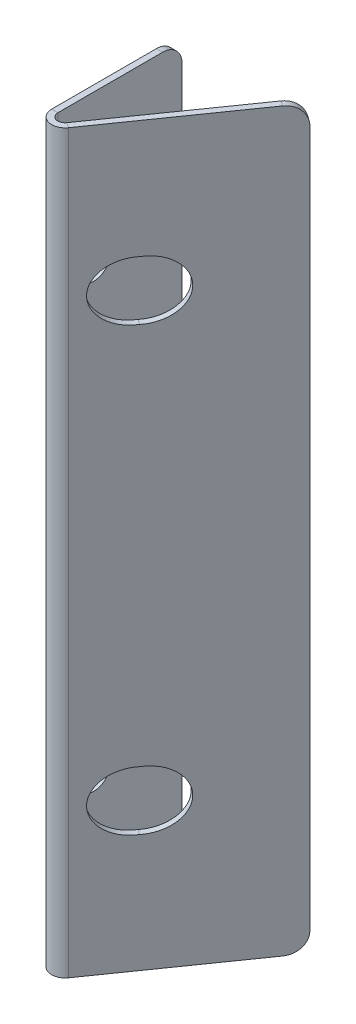
ISO-10303-21;
HEADER;
FILE_DESCRIPTION(('STEP AP214'),'2;1');
FILE_NAME('part.step','',(''),(''),'','','');
FILE_SCHEMA(('AUTOMOTIVE_DESIGN { 1 0 10303 214 1 1 1 1 }'));
ENDSEC;
DATA;
#1=APPLICATION_CONTEXT('core data for automotive mechanical design processes');
#2=APPLICATION_PROTOCOL_DEFINITION('international standard','automotive_design',2000,#1);
#3=PRODUCT_CONTEXT('',#1,'mechanical');
#4=PRODUCT('Part','Part','',(#3));
#5=PRODUCT_RELATED_PRODUCT_CATEGORY('part','',(#4));
#6=PRODUCT_DEFINITION_FORMATION('','',#4);
#7=PRODUCT_DEFINITION_CONTEXT('part definition',#1,'design');
#8=PRODUCT_DEFINITION('design','',#6,#7);
#9=PRODUCT_DEFINITION_SHAPE('','',#8);
#10=(LENGTH_UNIT() NAMED_UNIT(*) SI_UNIT(.MILLI.,.METRE.));
#11=(NAMED_UNIT(*) PLANE_ANGLE_UNIT() SI_UNIT($,.RADIAN.));
#12=(NAMED_UNIT(*) SI_UNIT($,.STERADIAN.) SOLID_ANGLE_UNIT());
#13=UNCERTAINTY_MEASURE_WITH_UNIT(LENGTH_MEASURE(1.E-05),#10,'distance_accuracy_value','');
#14=(GEOMETRIC_REPRESENTATION_CONTEXT(3) GLOBAL_UNCERTAINTY_ASSIGNED_CONTEXT((#13)) GLOBAL_UNIT_ASSIGNED_CONTEXT((#10,
#11,#12)) REPRESENTATION_CONTEXT('',''));
#15=CARTESIAN_POINT('',(0.,0.,0.));
#16=DIRECTION('',(0.,0.,1.));
#17=DIRECTION('',(1.,0.,0.));
#18=AXIS2_PLACEMENT_3D('',#15,#16,#17);
#19=CARTESIAN_POINT('',(0.520161548123511,0.,0.364221037082916));
#20=DIRECTION('',(-0.819152044288991,0.,-0.573576436351047));
#21=DIRECTION('',(-0.573576436351047,0.,0.819152044288991));
#22=AXIS2_PLACEMENT_3D('',#19,#20,#21);
#23=PLANE('',#22);
#24=CARTESIAN_POINT('',(4.9764370931218,-15.,-6.00000000000001));
#25=DIRECTION('',(-0.819152044288991,0.,-0.573576436351047));
#26=DIRECTION('',(-0.573576436351047,0.,0.819152044288991));
#27=AXIS2_PLACEMENT_3D('',#24,#25,#26);
#28=ELLIPSE('',#27,3.66232376628437,3.);
#29=CARTESIAN_POINT('',(4.84892193525177,-17.9944675251264,-5.81788948145852));
#30=VERTEX_POINT('',#29);
#31=CARTESIAN_POINT('',(4.84892193525177,-12.0055324748736,-5.81788948145852));
#32=VERTEX_POINT('',#31);
#33=EDGE_CURVE('E170',#30,#32,#28,.F.);
#34=ORIENTED_EDGE('',*,*,#33,.F.);
#35=CARTESIAN_POINT('',(4.72140677738179,-15.,-5.63577896291709));
#36=DIRECTION('',(-0.819152044288991,0.,-0.573576436351047));
#37=DIRECTION('',(-0.573576436351047,0.,0.819152044288991));
#38=AXIS2_PLACEMENT_3D('',#35,#36,#37);
#39=ELLIPSE('',#38,3.66232376628437,3.);
#40=EDGE_CURVE('E161',#32,#30,#39,.F.);
#41=ORIENTED_EDGE('',*,*,#40,.F.);
#42=EDGE_LOOP('',(#34,#41));
#43=FACE_BOUND('',#42,.T.);
#44=CARTESIAN_POINT('',(4.97643709312179,-60.,-6.));
#45=DIRECTION('',(-0.819152044288991,0.,-0.573576436351047));
#46=DIRECTION('',(-0.573576436351047,0.,0.819152044288991));
#47=AXIS2_PLACEMENT_3D('',#44,#45,#46);
#48=ELLIPSE('',#47,3.66232376628437,3.);
#49=CARTESIAN_POINT('',(4.84892193525195,-62.9944675251264,-5.81788948145878));
#50=VERTEX_POINT('',#49);
#51=CARTESIAN_POINT('',(4.84892193525196,-57.0055324748736,-5.81788948145878));
#52=VERTEX_POINT('',#51);
#53=EDGE_CURVE('E175',#50,#52,#48,.F.);
#54=ORIENTED_EDGE('',*,*,#53,.F.);
#55=CARTESIAN_POINT('',(4.72140677738178,-60.,-5.63577896291709));
#56=DIRECTION('',(-0.819152044288991,0.,-0.573576436351047));
#57=DIRECTION('',(-0.573576436351047,0.,0.819152044288991));
#58=AXIS2_PLACEMENT_3D('',#55,#56,#57);
#59=ELLIPSE('',#58,3.66232376628437,3.);
#60=EDGE_CURVE('E204',#52,#50,#59,.F.);
#61=ORIENTED_EDGE('',*,*,#60,.F.);
#62=EDGE_LOOP('',(#54,#61));
#63=FACE_BOUND('',#62,.T.);
#64=DIRECTION('',(0.573576436351047,0.,-0.819152044288991));
#65=VECTOR('',#64,1.);
#66=CARTESIAN_POINT('',(11.9916902751445,-75.,-16.0188198486969));
#67=LINE('',#66,#65);
#68=CARTESIAN_POINT('',(1.86014894394678,-75.,-1.54947929132165));
#69=VERTEX_POINT('',#68);
#70=CARTESIAN_POINT('',(10.8445374024424,-75.,-14.3805157601189));
#71=VERTEX_POINT('',#70);
#72=EDGE_CURVE('E235',#69,#71,#67,.T.);
#73=ORIENTED_EDGE('',*,*,#72,.T.);
#74=CARTESIAN_POINT('',(10.8445374024424,-73.,-14.3805157601189));
#75=DIRECTION('',(-0.819152044288991,0.,-0.573576436351047));
#76=DIRECTION('',(-0.573576436351047,0.,0.819152044288991));
#77=AXIS2_PLACEMENT_3D('',#74,#75,#76);
#78=CIRCLE('',#77,2.);
#79=CARTESIAN_POINT('',(11.9916902751445,-73.,-16.0188198486969));
#80=VERTEX_POINT('',#79);
#81=EDGE_CURVE('E312',#71,#80,#78,.F.);
#82=ORIENTED_EDGE('',*,*,#81,.T.);
#83=DIRECTION('',(0.,1.,0.));
#84=VECTOR('',#83,1.);
#85=CARTESIAN_POINT('',(11.9916902751445,0.,-16.0188198486969));
#86=LINE('',#85,#84);
#87=CARTESIAN_POINT('',(11.9916902751445,-2.,-16.0188198486969));
#88=VERTEX_POINT('',#87);
#89=EDGE_CURVE('E238',#80,#88,#86,.T.);
#90=ORIENTED_EDGE('',*,*,#89,.T.);
#91=CARTESIAN_POINT('',(10.8445374024424,-2.,-14.3805157601189));
#92=DIRECTION('',(-0.819152044288991,0.,-0.573576436351047));
#93=DIRECTION('',(-0.573576436351047,0.,0.819152044288991));
#94=AXIS2_PLACEMENT_3D('',#91,#92,#93);
#95=CIRCLE('',#94,2.);
#96=CARTESIAN_POINT('',(10.8445374024424,0.,-14.3805157601189));
#97=VERTEX_POINT('',#96);
#98=EDGE_CURVE('E53',#88,#97,#95,.F.);
#99=ORIENTED_EDGE('',*,*,#98,.T.);
#100=DIRECTION('',(-0.573576436351047,0.,0.819152044288991));
#101=VECTOR('',#100,1.);
#102=CARTESIAN_POINT('',(0.520161548123509,0.,0.364221037082915));
#103=LINE('',#102,#101);
#104=CARTESIAN_POINT('',(1.86014894394678,0.,-1.54947929132164));
#105=VERTEX_POINT('',#104);
#106=EDGE_CURVE('E233',#97,#105,#103,.T.);
#107=ORIENTED_EDGE('',*,*,#106,.T.);
#108=DIRECTION('',(0.,1.,0.));
#109=VECTOR('',#108,1.);
#110=CARTESIAN_POINT('',(1.86014894394678,0.,-1.54947929132164));
#111=LINE('',#110,#109);
#112=EDGE_CURVE('E227',#69,#105,#111,.T.);
#113=ORIENTED_EDGE('',*,*,#112,.F.);
#114=EDGE_LOOP('',(#73,#82,#90,#99,#107,#113));
#115=FACE_BOUND('',#114,.T.);
#116=ADVANCED_FACE('F38',(#43,#63,#115),#23,.F.);
#117=CARTESIAN_POINT('',(0.,0.,0.));
#118=DIRECTION('',(-0.819152044288991,0.,-0.573576436351047));
#119=DIRECTION('',(-0.573576436351047,0.,0.819152044288991));
#120=AXIS2_PLACEMENT_3D('',#117,#118,#119);
#121=PLANE('',#120);
#122=CARTESIAN_POINT('',(4.20124522925828,-15.,-6.00000000000001));
#123=DIRECTION('',(-0.819152044288991,0.,-0.573576436351047));
#124=DIRECTION('',(-0.573576436351047,0.,0.819152044288991));
#125=AXIS2_PLACEMENT_3D('',#122,#123,#124);
#126=ELLIPSE('',#125,3.66232376628437,3.);
#127=CARTESIAN_POINT('',(4.32876038712845,-12.0055324748736,-6.1821105185417));
#128=VERTEX_POINT('',#127);
#129=CARTESIAN_POINT('',(4.32876038712845,-17.9944675251264,-6.1821105185417));
#130=VERTEX_POINT('',#129);
#131=EDGE_CURVE('E158',#128,#130,#126,.F.);
#132=ORIENTED_EDGE('',*,*,#131,.T.);
#133=CARTESIAN_POINT('',(4.4562755449983,-15.,-6.36422103708292));
#134=DIRECTION('',(-0.819152044288991,0.,-0.573576436351047));
#135=DIRECTION('',(-0.573576436351047,0.,0.819152044288991));
#136=AXIS2_PLACEMENT_3D('',#133,#134,#135);
#137=ELLIPSE('',#136,3.66232376628437,3.);
#138=EDGE_CURVE('E165',#130,#128,#137,.F.);
#139=ORIENTED_EDGE('',*,*,#138,.T.);
#140=EDGE_LOOP('',(#132,#139));
#141=FACE_BOUND('',#140,.T.);
#142=CARTESIAN_POINT('',(4.20124522925827,-60.,-6.));
#143=DIRECTION('',(-0.819152044288991,0.,-0.573576436351047));
#144=DIRECTION('',(-0.573576436351047,0.,0.819152044288991));
#145=AXIS2_PLACEMENT_3D('',#142,#143,#144);
#146=ELLIPSE('',#145,3.66232376628437,3.);
#147=CARTESIAN_POINT('',(4.32876038712845,-57.0055324748736,-6.1821105185417));
#148=VERTEX_POINT('',#147);
#149=CARTESIAN_POINT('',(4.32876038712844,-62.9944675251264,-6.1821105185417));
#150=VERTEX_POINT('',#149);
#151=EDGE_CURVE('E203',#148,#150,#146,.F.);
#152=ORIENTED_EDGE('',*,*,#151,.T.);
#153=CARTESIAN_POINT('',(4.45627554499829,-60.,-6.36422103708292));
#154=DIRECTION('',(-0.819152044288991,0.,-0.573576436351047));
#155=DIRECTION('',(-0.573576436351047,0.,0.819152044288991));
#156=AXIS2_PLACEMENT_3D('',#153,#154,#155);
#157=ELLIPSE('',#156,3.66232376628437,3.);
#158=EDGE_CURVE('E181',#150,#148,#157,.F.);
#159=ORIENTED_EDGE('',*,*,#158,.T.);
#160=EDGE_LOOP('',(#152,#159));
#161=FACE_BOUND('',#160,.T.);
#162=DIRECTION('',(0.,1.,0.));
#163=VECTOR('',#162,1.);
#164=CARTESIAN_POINT('',(11.4715287270209,0.,-16.3830408857798));
#165=LINE('',#164,#163);
#166=CARTESIAN_POINT('',(11.4715287270209,-73.,-16.3830408857798));
#167=VERTEX_POINT('',#166);
#168=CARTESIAN_POINT('',(11.4715287270209,-2.,-16.3830408857798));
#169=VERTEX_POINT('',#168);
#170=EDGE_CURVE('E236',#167,#169,#165,.T.);
#171=ORIENTED_EDGE('',*,*,#170,.F.);
#172=CARTESIAN_POINT('',(10.3243758543189,-73.,-14.7447367972018));
#173=DIRECTION('',(-0.819152044288991,0.,-0.573576436351047));
#174=DIRECTION('',(-0.573576436351047,0.,0.819152044288991));
#175=AXIS2_PLACEMENT_3D('',#172,#173,#174);
#176=CIRCLE('',#175,2.);
#177=CARTESIAN_POINT('',(10.3243758543189,-75.,-14.7447367972018));
#178=VERTEX_POINT('',#177);
#179=EDGE_CURVE('E308',#167,#178,#176,.T.);
#180=ORIENTED_EDGE('',*,*,#179,.T.);
#181=DIRECTION('',(0.573576436351047,0.,-0.819152044288991));
#182=VECTOR('',#181,1.);
#183=CARTESIAN_POINT('',(11.4715287270209,-75.,-16.3830408857798));
#184=LINE('',#183,#182);
#185=CARTESIAN_POINT('',(1.33998739582328,-75.,-1.91370032840456));
#186=VERTEX_POINT('',#185);
#187=EDGE_CURVE('E242',#186,#178,#184,.T.);
#188=ORIENTED_EDGE('',*,*,#187,.F.);
#189=DIRECTION('',(0.,-1.,0.));
#190=VECTOR('',#189,1.);
#191=CARTESIAN_POINT('',(1.33998739582327,0.,-1.91370032840456));
#192=LINE('',#191,#190);
#193=CARTESIAN_POINT('',(1.33998739582327,0.,-1.91370032840456));
#194=VERTEX_POINT('',#193);
#195=EDGE_CURVE('E222',#194,#186,#192,.T.);
#196=ORIENTED_EDGE('',*,*,#195,.F.);
#197=DIRECTION('',(-0.573576436351047,0.,0.819152044288991));
#198=VECTOR('',#197,1.);
#199=CARTESIAN_POINT('',(0.,0.,0.));
#200=LINE('',#199,#198);
#201=CARTESIAN_POINT('',(10.3243758543189,0.,-14.7447367972018));
#202=VERTEX_POINT('',#201);
#203=EDGE_CURVE('E232',#202,#194,#200,.T.);
#204=ORIENTED_EDGE('',*,*,#203,.F.);
#205=CARTESIAN_POINT('',(10.3243758543189,-2.,-14.7447367972018));
#206=DIRECTION('',(-0.819152044288991,0.,-0.573576436351047));
#207=DIRECTION('',(-0.573576436351047,0.,0.819152044288991));
#208=AXIS2_PLACEMENT_3D('',#205,#206,#207);
#209=CIRCLE('',#208,2.);
#210=EDGE_CURVE('E306',#202,#169,#209,.T.);
#211=ORIENTED_EDGE('',*,*,#210,.T.);
#212=EDGE_LOOP('',(#171,#180,#188,#196,#204,#211));
#213=FACE_BOUND('',#212,.T.);
#214=ADVANCED_FACE('F172',(#141,#161,#213),#121,.T.);
#215=CARTESIAN_POINT('',(-0.635,0.,0.));
#216=DIRECTION('',(1.,0.,0.));
#217=DIRECTION('',(0.,0.,-1.));
#218=AXIS2_PLACEMENT_3D('',#215,#216,#217);
#219=PLANE('',#218);
#220=CARTESIAN_POINT('',(-0.635,-15.,-6.00000000000001));
#221=DIRECTION('',(1.,0.,0.));
#222=DIRECTION('',(0.,0.,-1.));
#223=AXIS2_PLACEMENT_3D('',#220,#221,#222);
#224=CIRCLE('',#223,1.7);
#225=CARTESIAN_POINT('',(-0.635,-15.,-7.70000000000001));
#226=VERTEX_POINT('',#225);
#227=EDGE_CURVE('E216',#226,#226,#224,.T.);
#228=ORIENTED_EDGE('',*,*,#227,.T.);
#229=EDGE_LOOP('',(#228));
#230=FACE_BOUND('',#229,.T.);
#231=DIRECTION('',(0.,1.,0.));
#232=VECTOR('',#231,1.);
#233=CARTESIAN_POINT('',(-0.635,0.,-15.));
#234=LINE('',#233,#232);
#235=CARTESIAN_POINT('',(-0.635,-73.,-15.));
#236=VERTEX_POINT('',#235);
#237=CARTESIAN_POINT('',(-0.635,-2.,-15.));
#238=VERTEX_POINT('',#237);
#239=EDGE_CURVE('E273',#236,#238,#234,.T.);
#240=ORIENTED_EDGE('',*,*,#239,.F.);
#241=CARTESIAN_POINT('',(-0.635,-73.,-13.));
#242=DIRECTION('',(1.,0.,0.));
#243=DIRECTION('',(0.,0.,-1.));
#244=AXIS2_PLACEMENT_3D('',#241,#242,#243);
#245=CIRCLE('',#244,2.);
#246=CARTESIAN_POINT('',(-0.635,-75.,-13.));
#247=VERTEX_POINT('',#246);
#248=EDGE_CURVE('E299',#236,#247,#245,.F.);
#249=ORIENTED_EDGE('',*,*,#248,.T.);
#250=DIRECTION('',(0.,0.,-1.));
#251=VECTOR('',#250,1.);
#252=CARTESIAN_POINT('',(-0.635,-75.,0.));
#253=LINE('',#252,#251);
#254=CARTESIAN_POINT('',(-0.635000000000007,-75.,-2.33619673142075));
#255=VERTEX_POINT('',#254);
#256=EDGE_CURVE('E270',#255,#247,#253,.T.);
#257=ORIENTED_EDGE('',*,*,#256,.F.);
#258=DIRECTION('',(0.,-1.,0.));
#259=VECTOR('',#258,1.);
#260=CARTESIAN_POINT('',(-0.635000000000007,-75.,-2.33619673142075));
#261=LINE('',#260,#259);
#262=CARTESIAN_POINT('',(-0.635,0.,-2.33619673142075));
#263=VERTEX_POINT('',#262);
#264=EDGE_CURVE('E246',#255,#263,#261,.F.);
#265=ORIENTED_EDGE('',*,*,#264,.T.);
#266=DIRECTION('',(0.,0.,1.));
#267=VECTOR('',#266,1.);
#268=CARTESIAN_POINT('',(-0.635,0.,0.));
#269=LINE('',#268,#267);
#270=CARTESIAN_POINT('',(-0.635,0.,-13.));
#271=VERTEX_POINT('',#270);
#272=EDGE_CURVE('E277',#271,#263,#269,.T.);
#273=ORIENTED_EDGE('',*,*,#272,.F.);
#274=CARTESIAN_POINT('',(-0.635,-2.,-13.));
#275=DIRECTION('',(1.,0.,0.));
#276=DIRECTION('',(0.,0.,-1.));
#277=AXIS2_PLACEMENT_3D('',#274,#275,#276);
#278=CIRCLE('',#277,2.);
#279=EDGE_CURVE('E297',#271,#238,#278,.F.);
#280=ORIENTED_EDGE('',*,*,#279,.T.);
#281=EDGE_LOOP('',(#240,#249,#257,#265,#273,#280));
#282=FACE_BOUND('',#281,.T.);
#283=CARTESIAN_POINT('',(-0.635,-60.,-6.));
#284=DIRECTION('',(1.,0.,0.));
#285=DIRECTION('',(0.,0.,-1.));
#286=AXIS2_PLACEMENT_3D('',#283,#284,#285);
#287=CIRCLE('',#286,1.7);
#288=CARTESIAN_POINT('',(-0.635,-60.,-7.7));
#289=VERTEX_POINT('',#288);
#290=EDGE_CURVE('E210',#289,#289,#287,.T.);
#291=ORIENTED_EDGE('',*,*,#290,.T.);
#292=EDGE_LOOP('',(#291));
#293=FACE_BOUND('',#292,.T.);
#294=ADVANCED_FACE('F323',(#230,#282,#293),#219,.F.);
#295=CARTESIAN_POINT('',(0.,0.,0.));
#296=DIRECTION('',(1.,0.,0.));
#297=DIRECTION('',(0.,0.,-1.));
#298=AXIS2_PLACEMENT_3D('',#295,#296,#297);
#299=PLANE('',#298);
#300=CARTESIAN_POINT('',(0.,-15.,-6.00000000000001));
#301=DIRECTION('',(1.,0.,0.));
#302=DIRECTION('',(0.,0.,-1.));
#303=AXIS2_PLACEMENT_3D('',#300,#301,#302);
#304=CIRCLE('',#303,1.7);
#305=CARTESIAN_POINT('',(0.,-15.,-7.70000000000001));
#306=VERTEX_POINT('',#305);
#307=EDGE_CURVE('E213',#306,#306,#304,.T.);
#308=ORIENTED_EDGE('',*,*,#307,.F.);
#309=EDGE_LOOP('',(#308));
#310=FACE_BOUND('',#309,.T.);
#311=DIRECTION('',(0.,0.,-1.));
#312=VECTOR('',#311,1.);
#313=CARTESIAN_POINT('',(0.,-75.,0.));
#314=LINE('',#313,#312);
#315=CARTESIAN_POINT('',(0.,-75.,-2.33619673142075));
#316=VERTEX_POINT('',#315);
#317=CARTESIAN_POINT('',(0.,-75.,-13.));
#318=VERTEX_POINT('',#317);
#319=EDGE_CURVE('E267',#316,#318,#314,.T.);
#320=ORIENTED_EDGE('',*,*,#319,.T.);
#321=CARTESIAN_POINT('',(0.,-73.,-13.));
#322=DIRECTION('',(1.,0.,0.));
#323=DIRECTION('',(0.,0.,-1.));
#324=AXIS2_PLACEMENT_3D('',#321,#322,#323);
#325=CIRCLE('',#324,2.);
#326=CARTESIAN_POINT('',(0.,-73.,-15.));
#327=VERTEX_POINT('',#326);
#328=EDGE_CURVE('E290',#318,#327,#325,.T.);
#329=ORIENTED_EDGE('',*,*,#328,.T.);
#330=DIRECTION('',(0.,1.,0.));
#331=VECTOR('',#330,1.);
#332=CARTESIAN_POINT('',(0.,0.,-15.));
#333=LINE('',#332,#331);
#334=CARTESIAN_POINT('',(0.,-2.,-15.));
#335=VERTEX_POINT('',#334);
#336=EDGE_CURVE('E282',#327,#335,#333,.T.);
#337=ORIENTED_EDGE('',*,*,#336,.T.);
#338=CARTESIAN_POINT('',(0.,-2.,-13.));
#339=DIRECTION('',(1.,0.,0.));
#340=DIRECTION('',(0.,0.,-1.));
#341=AXIS2_PLACEMENT_3D('',#338,#339,#340);
#342=CIRCLE('',#341,2.);
#343=CARTESIAN_POINT('',(0.,0.,-13.));
#344=VERTEX_POINT('',#343);
#345=EDGE_CURVE('E288',#335,#344,#342,.T.);
#346=ORIENTED_EDGE('',*,*,#345,.T.);
#347=DIRECTION('',(0.,0.,1.));
#348=VECTOR('',#347,1.);
#349=CARTESIAN_POINT('',(0.,0.,0.));
#350=LINE('',#349,#348);
#351=CARTESIAN_POINT('',(0.,0.,-2.33619673142075));
#352=VERTEX_POINT('',#351);
#353=EDGE_CURVE('E274',#344,#352,#350,.T.);
#354=ORIENTED_EDGE('',*,*,#353,.T.);
#355=DIRECTION('',(0.,-1.,0.));
#356=VECTOR('',#355,1.);
#357=CARTESIAN_POINT('',(0.,-75.,-2.33619673142075));
#358=LINE('',#357,#356);
#359=EDGE_CURVE('E259',#316,#352,#358,.F.);
#360=ORIENTED_EDGE('',*,*,#359,.F.);
#361=EDGE_LOOP('',(#320,#329,#337,#346,#354,#360));
#362=FACE_BOUND('',#361,.T.);
#363=CARTESIAN_POINT('',(0.,-60.,-6.));
#364=DIRECTION('',(1.,0.,0.));
#365=DIRECTION('',(0.,0.,-1.));
#366=AXIS2_PLACEMENT_3D('',#363,#364,#365);
#367=CIRCLE('',#366,1.7);
#368=CARTESIAN_POINT('',(0.,-60.,-7.7));
#369=VERTEX_POINT('',#368);
#370=EDGE_CURVE('E206',#369,#369,#367,.T.);
#371=ORIENTED_EDGE('',*,*,#370,.F.);
#372=EDGE_LOOP('',(#371));
#373=FACE_BOUND('',#372,.T.);
#374=ADVANCED_FACE('F333',(#310,#362,#373),#299,.T.);
#375=CARTESIAN_POINT('',(-0.635,-75.,0.));
#376=DIRECTION('',(0.,-1.,0.));
#377=DIRECTION('',(0.,0.,-1.));
#378=AXIS2_PLACEMENT_3D('',#375,#376,#377);
#379=PLANE('',#378);
#380=ORIENTED_EDGE('',*,*,#256,.T.);
#381=DIRECTION('',(1.,0.,0.));
#382=VECTOR('',#381,1.);
#383=CARTESIAN_POINT('',(-0.635,-75.,-13.));
#384=LINE('',#383,#382);
#385=EDGE_CURVE('E279',#247,#318,#384,.T.);
#386=ORIENTED_EDGE('',*,*,#385,.T.);
#387=ORIENTED_EDGE('',*,*,#319,.F.);
#388=DIRECTION('',(-1.,0.,0.));
#389=VECTOR('',#388,1.);
#390=CARTESIAN_POINT('',(0.,-75.,-2.33619673142075));
#391=LINE('',#390,#389);
#392=EDGE_CURVE('E253',#316,#255,#391,.T.);
#393=ORIENTED_EDGE('',*,*,#392,.T.);
#394=EDGE_LOOP('',(#380,#386,#387,#393));
#395=FACE_BOUND('',#394,.T.);
#396=ADVANCED_FACE('F341',(#395),#379,.T.);
#397=CARTESIAN_POINT('',(-0.635,0.,0.));
#398=DIRECTION('',(0.,1.,0.));
#399=DIRECTION('',(0.,0.,1.));
#400=AXIS2_PLACEMENT_3D('',#397,#398,#399);
#401=PLANE('',#400);
#402=ORIENTED_EDGE('',*,*,#353,.F.);
#403=DIRECTION('',(1.,0.,0.));
#404=VECTOR('',#403,1.);
#405=CARTESIAN_POINT('',(-0.635,0.,-13.));
#406=LINE('',#405,#404);
#407=EDGE_CURVE('E46',#344,#271,#406,.F.);
#408=ORIENTED_EDGE('',*,*,#407,.T.);
#409=ORIENTED_EDGE('',*,*,#272,.T.);
#410=DIRECTION('',(-1.,0.,0.));
#411=VECTOR('',#410,1.);
#412=CARTESIAN_POINT('',(0.,0.,-2.33619673142075));
#413=LINE('',#412,#411);
#414=EDGE_CURVE('E264',#352,#263,#413,.T.);
#415=ORIENTED_EDGE('',*,*,#414,.F.);
#416=EDGE_LOOP('',(#402,#408,#409,#415));
#417=FACE_BOUND('',#416,.T.);
#418=ADVANCED_FACE('F317',(#417),#401,.T.);
#419=CARTESIAN_POINT('',(-0.635,0.,-15.));
#420=DIRECTION('',(0.,0.,-1.));
#421=DIRECTION('',(0.,1.,0.));
#422=AXIS2_PLACEMENT_3D('',#419,#420,#421);
#423=PLANE('',#422);
#424=ORIENTED_EDGE('',*,*,#336,.F.);
#425=DIRECTION('',(1.,0.,0.));
#426=VECTOR('',#425,1.);
#427=CARTESIAN_POINT('',(-0.635,-73.,-15.));
#428=LINE('',#427,#426);
#429=EDGE_CURVE('E295',#327,#236,#428,.F.);
#430=ORIENTED_EDGE('',*,*,#429,.T.);
#431=ORIENTED_EDGE('',*,*,#239,.T.);
#432=DIRECTION('',(1.,0.,0.));
#433=VECTOR('',#432,1.);
#434=CARTESIAN_POINT('',(-0.635,-2.,-15.));
#435=LINE('',#434,#433);
#436=EDGE_CURVE('E292',#238,#335,#435,.T.);
#437=ORIENTED_EDGE('',*,*,#436,.T.);
#438=EDGE_LOOP('',(#424,#430,#431,#437));
#439=FACE_BOUND('',#438,.T.);
#440=ADVANCED_FACE('F330',(#439),#423,.T.);
#441=CARTESIAN_POINT('',(0.736599999999996,0.,-2.33619673142074));
#442=DIRECTION('',(0.,1.,0.));
#443=DIRECTION('',(-1.,0.,0.));
#444=AXIS2_PLACEMENT_3D('',#441,#442,#443);
#445=PLANE('',#444);
#446=DIRECTION('',(0.819152044288991,0.,0.573576436351047));
#447=VECTOR('',#446,1.);
#448=CARTESIAN_POINT('',(1.33998739582327,0.,-1.91370032840456));
#449=LINE('',#448,#447);
#450=EDGE_CURVE('E219',#194,#105,#449,.T.);
#451=ORIENTED_EDGE('',*,*,#450,.F.);
#452=CARTESIAN_POINT('',(0.736599999999996,0.,-2.33619673142074));
#453=DIRECTION('',(0.,-1.,0.));
#454=DIRECTION('',(1.,0.,0.));
#455=AXIS2_PLACEMENT_3D('',#452,#453,#454);
#456=CIRCLE('',#455,0.736600000000008);
#457=EDGE_CURVE('E256',#352,#194,#456,.F.);
#458=ORIENTED_EDGE('',*,*,#457,.F.);
#459=ORIENTED_EDGE('',*,*,#414,.T.);
#460=CARTESIAN_POINT('',(0.736599999999996,0.,-2.33619673142074));
#461=DIRECTION('',(0.,-1.,0.));
#462=DIRECTION('',(1.,0.,0.));
#463=AXIS2_PLACEMENT_3D('',#460,#461,#462);
#464=CIRCLE('',#463,1.37160000000001);
#465=EDGE_CURVE('E249',#263,#105,#464,.F.);
#466=ORIENTED_EDGE('',*,*,#465,.T.);
#467=EDGE_LOOP('',(#451,#458,#459,#466));
#468=FACE_BOUND('',#467,.T.);
#469=ADVANCED_FACE('F406',(#468),#445,.T.);
#470=CARTESIAN_POINT('',(0.736600000000001,-75.,-2.33619673142074));
#471=DIRECTION('',(0.,1.,0.));
#472=DIRECTION('',(-1.,0.,0.));
#473=AXIS2_PLACEMENT_3D('',#470,#471,#472);
#474=PLANE('',#473);
#475=CARTESIAN_POINT('',(0.736600000000001,-75.,-2.33619673142074));
#476=DIRECTION('',(0.,-1.,0.));
#477=DIRECTION('',(1.,0.,0.));
#478=AXIS2_PLACEMENT_3D('',#475,#476,#477);
#479=CIRCLE('',#478,0.736600000000008);
#480=EDGE_CURVE('E240',#186,#316,#479,.T.);
#481=ORIENTED_EDGE('',*,*,#480,.F.);
#482=DIRECTION('',(0.819152044288991,0.,0.573576436351047));
#483=VECTOR('',#482,1.);
#484=CARTESIAN_POINT('',(1.33998739582327,-75.,-1.91370032840457));
#485=LINE('',#484,#483);
#486=EDGE_CURVE('E224',#186,#69,#485,.T.);
#487=ORIENTED_EDGE('',*,*,#486,.T.);
#488=CARTESIAN_POINT('',(0.736600000000001,-75.,-2.33619673142074));
#489=DIRECTION('',(0.,-1.,0.));
#490=DIRECTION('',(1.,0.,0.));
#491=AXIS2_PLACEMENT_3D('',#488,#489,#490);
#492=CIRCLE('',#491,1.37160000000001);
#493=EDGE_CURVE('E250',#69,#255,#492,.T.);
#494=ORIENTED_EDGE('',*,*,#493,.T.);
#495=ORIENTED_EDGE('',*,*,#392,.F.);
#496=EDGE_LOOP('',(#481,#487,#494,#495));
#497=FACE_BOUND('',#496,.T.);
#498=ADVANCED_FACE('F348',(#497),#474,.F.);
#499=CARTESIAN_POINT('',(0.736600000000001,-75.,-2.33619673142074));
#500=DIRECTION('',(0.,-1.,0.));
#501=DIRECTION('',(0.819152044288991,0.,0.573576436351047));
#502=AXIS2_PLACEMENT_3D('',#499,#500,#501);
#503=CYLINDRICAL_SURFACE('',#502,1.37160000000001);
#504=ORIENTED_EDGE('',*,*,#264,.F.);
#505=ORIENTED_EDGE('',*,*,#493,.F.);
#506=ORIENTED_EDGE('',*,*,#112,.T.);
#507=ORIENTED_EDGE('',*,*,#465,.F.);
#508=EDGE_LOOP('',(#504,#505,#506,#507));
#509=FACE_BOUND('',#508,.T.);
#510=ADVANCED_FACE('F347',(#509),#503,.T.);
#511=CARTESIAN_POINT('',(0.736600000000001,-75.,-2.33619673142074));
#512=DIRECTION('',(0.,-1.,0.));
#513=DIRECTION('',(0.819152044288991,0.,0.573576436351047));
#514=AXIS2_PLACEMENT_3D('',#511,#512,#513);
#515=CYLINDRICAL_SURFACE('',#514,0.736600000000008);
#516=ORIENTED_EDGE('',*,*,#359,.T.);
#517=ORIENTED_EDGE('',*,*,#457,.T.);
#518=ORIENTED_EDGE('',*,*,#195,.T.);
#519=ORIENTED_EDGE('',*,*,#480,.T.);
#520=EDGE_LOOP('',(#516,#517,#518,#519));
#521=FACE_BOUND('',#520,.T.);
#522=ADVANCED_FACE('F365',(#521),#515,.F.);
#523=CARTESIAN_POINT('',(0.520161548123509,0.,0.364221037082915));
#524=DIRECTION('',(0.,-1.,0.));
#525=DIRECTION('',(0.,0.,-1.));
#526=AXIS2_PLACEMENT_3D('',#523,#524,#525);
#527=PLANE('',#526);
#528=ORIENTED_EDGE('',*,*,#106,.F.);
#529=DIRECTION('',(-0.819152044288991,0.,-0.573576436351047));
#530=VECTOR('',#529,1.);
#531=CARTESIAN_POINT('',(10.8445374024424,0.,-14.3805157601189));
#532=LINE('',#531,#530);
#533=EDGE_CURVE('E11',#97,#202,#532,.T.);
#534=ORIENTED_EDGE('',*,*,#533,.T.);
#535=ORIENTED_EDGE('',*,*,#203,.T.);
#536=ORIENTED_EDGE('',*,*,#450,.T.);
#537=EDGE_LOOP('',(#528,#534,#535,#536));
#538=FACE_BOUND('',#537,.T.);
#539=ADVANCED_FACE('F356',(#538),#527,.F.);
#540=CARTESIAN_POINT('',(11.9916902751445,-75.,-16.0188198486969));
#541=DIRECTION('',(0.,1.,0.));
#542=DIRECTION('',(-1.,0.,0.));
#543=AXIS2_PLACEMENT_3D('',#540,#541,#542);
#544=PLANE('',#543);
#545=ORIENTED_EDGE('',*,*,#187,.T.);
#546=DIRECTION('',(-0.819152044288991,0.,-0.573576436351047));
#547=VECTOR('',#546,1.);
#548=CARTESIAN_POINT('',(10.8445374024424,-75.,-14.3805157601189));
#549=LINE('',#548,#547);
#550=EDGE_CURVE('E61',#178,#71,#549,.F.);
#551=ORIENTED_EDGE('',*,*,#550,.T.);
#552=ORIENTED_EDGE('',*,*,#72,.F.);
#553=ORIENTED_EDGE('',*,*,#486,.F.);
#554=EDGE_LOOP('',(#545,#551,#552,#553));
#555=FACE_BOUND('',#554,.T.);
#556=ADVANCED_FACE('F353',(#555),#544,.F.);
#557=CARTESIAN_POINT('',(11.9916902751445,0.,-16.0188198486969));
#558=DIRECTION('',(-0.573576436351047,0.,0.819152044288991));
#559=DIRECTION('',(0.819152044288991,0.,0.573576436351047));
#560=AXIS2_PLACEMENT_3D('',#557,#558,#559);
#561=PLANE('',#560);
#562=ORIENTED_EDGE('',*,*,#89,.F.);
#563=DIRECTION('',(-0.819152044288991,0.,-0.573576436351047));
#564=VECTOR('',#563,1.);
#565=CARTESIAN_POINT('',(11.9916902751445,-73.,-16.0188198486969));
#566=LINE('',#565,#564);
#567=EDGE_CURVE('E303',#80,#167,#566,.T.);
#568=ORIENTED_EDGE('',*,*,#567,.T.);
#569=ORIENTED_EDGE('',*,*,#170,.T.);
#570=DIRECTION('',(-0.819152044288991,0.,-0.573576436351047));
#571=VECTOR('',#570,1.);
#572=CARTESIAN_POINT('',(11.9916902751445,-2.,-16.0188198486969));
#573=LINE('',#572,#571);
#574=EDGE_CURVE('E301',#169,#88,#573,.F.);
#575=ORIENTED_EDGE('',*,*,#574,.T.);
#576=EDGE_LOOP('',(#562,#568,#569,#575));
#577=FACE_BOUND('',#576,.T.);
#578=ADVANCED_FACE('F355',(#577),#561,.F.);
#579=CARTESIAN_POINT('',(0.,-15.,-6.00000000000001));
#580=DIRECTION('',(1.,0.,0.));
#581=DIRECTION('',(0.,0.,-1.));
#582=AXIS2_PLACEMENT_3D('',#579,#580,#581);
#583=CYLINDRICAL_SURFACE('',#582,1.7);
#584=ORIENTED_EDGE('',*,*,#227,.F.);
#585=EDGE_LOOP('',(#584));
#586=FACE_BOUND('',#585,.T.);
#587=ORIENTED_EDGE('',*,*,#307,.T.);
#588=EDGE_LOOP('',(#587));
#589=FACE_BOUND('',#588,.T.);
#590=ADVANCED_FACE('F362',(#586,#589),#583,.F.);
#591=CARTESIAN_POINT('',(0.,-60.,-6.));
#592=DIRECTION('',(1.,0.,0.));
#593=DIRECTION('',(0.,0.,-1.));
#594=AXIS2_PLACEMENT_3D('',#591,#592,#593);
#595=CYLINDRICAL_SURFACE('',#594,1.7);
#596=ORIENTED_EDGE('',*,*,#290,.F.);
#597=EDGE_LOOP('',(#596));
#598=FACE_BOUND('',#597,.T.);
#599=ORIENTED_EDGE('',*,*,#370,.T.);
#600=EDGE_LOOP('',(#599));
#601=FACE_BOUND('',#600,.T.);
#602=ADVANCED_FACE('F379',(#598,#601),#595,.F.);
#603=CARTESIAN_POINT('',(4.20124522925827,-60.,-6.));
#604=DIRECTION('',(-0.819152044288991,0.,-0.573576436351047));
#605=DIRECTION('',(-0.573576436351047,0.,0.819152044288991));
#606=AXIS2_PLACEMENT_3D('',#603,#604,#605);
#607=ELLIPSE('',#606,3.66232376628437,3.);
#608=DIRECTION('',(-0.819152044288991,0.,-0.573576436351047));
#609=VECTOR('',#608,1.);
#610=SURFACE_OF_LINEAR_EXTRUSION('',#607,#609);
#611=DIRECTION('',(-0.819152044288991,0.,-0.573576436351047));
#612=VECTOR('',#611,1.);
#613=CARTESIAN_POINT('',(4.84892193525179,-57.0055324748736,-5.81788948145856));
#614=LINE('',#613,#612);
#615=EDGE_CURVE('E200',#148,#52,#614,.F.);
#616=ORIENTED_EDGE('',*,*,#615,.T.);
#617=ORIENTED_EDGE('',*,*,#60,.T.);
#618=DIRECTION('',(-0.819152044288991,0.,-0.573576436351047));
#619=VECTOR('',#618,1.);
#620=CARTESIAN_POINT('',(4.84892193525182,-62.9944675251264,-5.81788948145859));
#621=LINE('',#620,#619);
#622=EDGE_CURVE('E198',#50,#150,#621,.T.);
#623=ORIENTED_EDGE('',*,*,#622,.T.);
#624=ORIENTED_EDGE('',*,*,#151,.F.);
#625=EDGE_LOOP('',(#616,#617,#623,#624));
#626=FACE_BOUND('',#625,.T.);
#627=ADVANCED_FACE('F192',(#626),#610,.F.);
#628=CARTESIAN_POINT('',(4.97643709312179,-60.,-6.));
#629=DIRECTION('',(-0.819152044288991,0.,-0.573576436351047));
#630=DIRECTION('',(-0.573576436351047,0.,0.819152044288991));
#631=AXIS2_PLACEMENT_3D('',#628,#629,#630);
#632=ELLIPSE('',#631,3.66232376628437,3.);
#633=DIRECTION('',(-0.819152044288991,0.,-0.573576436351047));
#634=VECTOR('',#633,1.);
#635=SURFACE_OF_LINEAR_EXTRUSION('',#632,#634);
#636=ORIENTED_EDGE('',*,*,#158,.F.);
#637=ORIENTED_EDGE('',*,*,#622,.F.);
#638=ORIENTED_EDGE('',*,*,#53,.T.);
#639=ORIENTED_EDGE('',*,*,#615,.F.);
#640=EDGE_LOOP('',(#636,#637,#638,#639));
#641=FACE_BOUND('',#640,.T.);
#642=ADVANCED_FACE('F187',(#641),#635,.F.);
#643=CARTESIAN_POINT('',(4.20124522925828,-15.,-6.00000000000001));
#644=DIRECTION('',(-0.819152044288991,0.,-0.573576436351047));
#645=DIRECTION('',(-0.573576436351047,0.,0.819152044288991));
#646=AXIS2_PLACEMENT_3D('',#643,#644,#645);
#647=ELLIPSE('',#646,3.66232376628437,3.);
#648=DIRECTION('',(-0.819152044288991,0.,-0.573576436351047));
#649=VECTOR('',#648,1.);
#650=SURFACE_OF_LINEAR_EXTRUSION('',#647,#649);
#651=DIRECTION('',(-0.819152044288991,0.,-0.573576436351047));
#652=VECTOR('',#651,1.);
#653=CARTESIAN_POINT('',(4.84892193525179,-12.0055324748736,-5.81788948145854));
#654=LINE('',#653,#652);
#655=EDGE_CURVE('E164',#128,#32,#654,.F.);
#656=ORIENTED_EDGE('',*,*,#655,.T.);
#657=ORIENTED_EDGE('',*,*,#40,.T.);
#658=DIRECTION('',(-0.819152044288991,0.,-0.573576436351047));
#659=VECTOR('',#658,1.);
#660=CARTESIAN_POINT('',(4.8489219352518,-17.9944675251264,-5.81788948145856));
#661=LINE('',#660,#659);
#662=EDGE_CURVE('E153',#30,#130,#661,.T.);
#663=ORIENTED_EDGE('',*,*,#662,.T.);
#664=ORIENTED_EDGE('',*,*,#131,.F.);
#665=EDGE_LOOP('',(#656,#657,#663,#664));
#666=FACE_BOUND('',#665,.T.);
#667=ADVANCED_FACE('F156',(#666),#650,.F.);
#668=CARTESIAN_POINT('',(4.9764370931218,-15.,-6.00000000000001));
#669=DIRECTION('',(-0.819152044288991,0.,-0.573576436351047));
#670=DIRECTION('',(-0.573576436351047,0.,0.819152044288991));
#671=AXIS2_PLACEMENT_3D('',#668,#669,#670);
#672=ELLIPSE('',#671,3.66232376628437,3.);
#673=DIRECTION('',(-0.819152044288991,0.,-0.573576436351047));
#674=VECTOR('',#673,1.);
#675=SURFACE_OF_LINEAR_EXTRUSION('',#672,#674);
#676=ORIENTED_EDGE('',*,*,#138,.F.);
#677=ORIENTED_EDGE('',*,*,#662,.F.);
#678=ORIENTED_EDGE('',*,*,#33,.T.);
#679=ORIENTED_EDGE('',*,*,#655,.F.);
#680=EDGE_LOOP('',(#676,#677,#678,#679));
#681=FACE_BOUND('',#680,.T.);
#682=ADVANCED_FACE('F168',(#681),#675,.F.);
#683=CARTESIAN_POINT('',(-0.635,-73.,-13.));
#684=DIRECTION('',(1.,0.,0.));
#685=DIRECTION('',(0.,0.,-1.));
#686=AXIS2_PLACEMENT_3D('',#683,#684,#685);
#687=CYLINDRICAL_SURFACE('',#686,2.);
#688=ORIENTED_EDGE('',*,*,#248,.F.);
#689=ORIENTED_EDGE('',*,*,#429,.F.);
#690=ORIENTED_EDGE('',*,*,#328,.F.);
#691=ORIENTED_EDGE('',*,*,#385,.F.);
#692=EDGE_LOOP('',(#688,#689,#690,#691));
#693=FACE_BOUND('',#692,.T.);
#694=ADVANCED_FACE('F339',(#693),#687,.T.);
#695=CARTESIAN_POINT('',(10.8445374024424,-73.,-14.3805157601189));
#696=DIRECTION('',(-0.819152044288991,0.,-0.573576436351047));
#697=DIRECTION('',(-0.573576436351047,0.,0.819152044288991));
#698=AXIS2_PLACEMENT_3D('',#695,#696,#697);
#699=CYLINDRICAL_SURFACE('',#698,2.);
#700=ORIENTED_EDGE('',*,*,#81,.F.);
#701=ORIENTED_EDGE('',*,*,#550,.F.);
#702=ORIENTED_EDGE('',*,*,#179,.F.);
#703=ORIENTED_EDGE('',*,*,#567,.F.);
#704=EDGE_LOOP('',(#700,#701,#702,#703));
#705=FACE_BOUND('',#704,.T.);
#706=ADVANCED_FACE('F410',(#705),#699,.T.);
#707=CARTESIAN_POINT('',(-0.635,-2.,-13.));
#708=DIRECTION('',(1.,0.,0.));
#709=DIRECTION('',(0.,0.,-1.));
#710=AXIS2_PLACEMENT_3D('',#707,#708,#709);
#711=CYLINDRICAL_SURFACE('',#710,2.);
#712=ORIENTED_EDGE('',*,*,#279,.F.);
#713=ORIENTED_EDGE('',*,*,#407,.F.);
#714=ORIENTED_EDGE('',*,*,#345,.F.);
#715=ORIENTED_EDGE('',*,*,#436,.F.);
#716=EDGE_LOOP('',(#712,#713,#714,#715));
#717=FACE_BOUND('',#716,.T.);
#718=ADVANCED_FACE('F327',(#717),#711,.T.);
#719=CARTESIAN_POINT('',(10.8445374024424,-2.,-14.3805157601189));
#720=DIRECTION('',(-0.819152044288991,0.,-0.573576436351047));
#721=DIRECTION('',(-0.573576436351047,0.,0.819152044288991));
#722=AXIS2_PLACEMENT_3D('',#719,#720,#721);
#723=CYLINDRICAL_SURFACE('',#722,2.);
#724=ORIENTED_EDGE('',*,*,#98,.F.);
#725=ORIENTED_EDGE('',*,*,#574,.F.);
#726=ORIENTED_EDGE('',*,*,#210,.F.);
#727=ORIENTED_EDGE('',*,*,#533,.F.);
#728=EDGE_LOOP('',(#724,#725,#726,#727));
#729=FACE_BOUND('',#728,.T.);
#730=ADVANCED_FACE('F40',(#729),#723,.T.);
#731=CLOSED_SHELL('',(#116,#214,#294,#374,#396,#418,#440,#469,#498,#510,#522,#539,#556,#578,
#590,#602,#627,#642,#667,#682,#694,#706,#718,#730));
#732=MANIFOLD_SOLID_BREP('B2',#731);
#733=ADVANCED_BREP_SHAPE_REPRESENTATION('',(#18,#732),#14);
#734=SHAPE_DEFINITION_REPRESENTATION(#9,#733);
ENDSEC;
END-ISO-10303-21;
